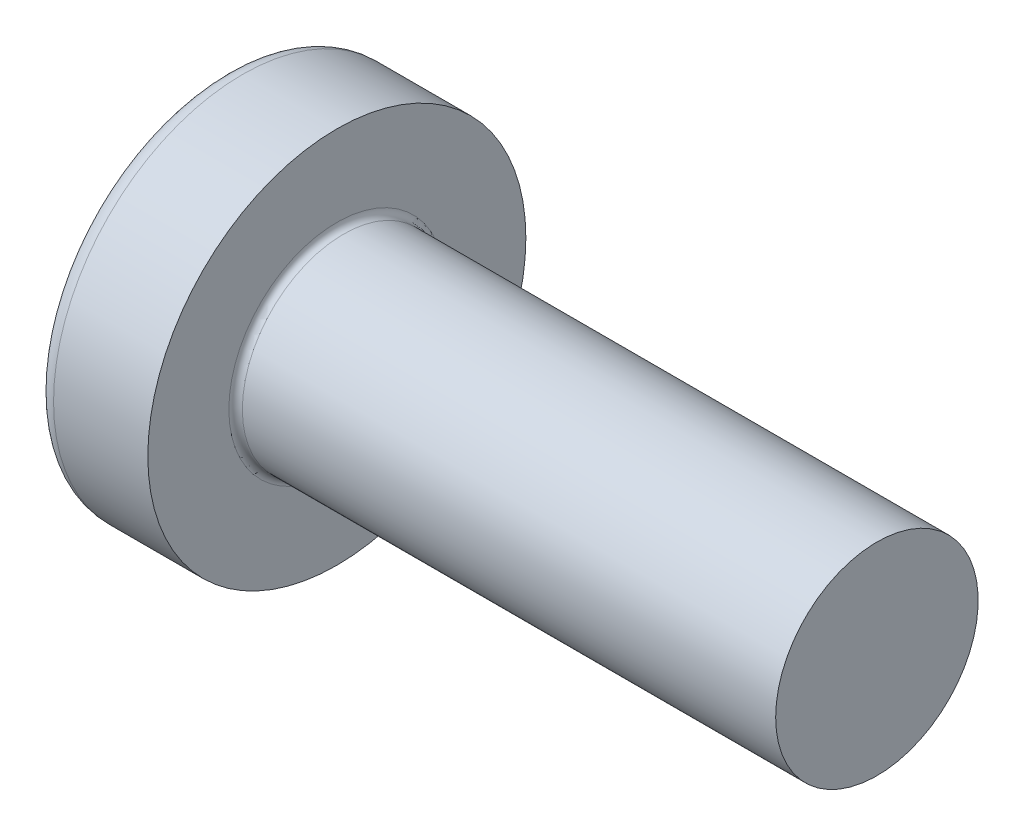
ISO-10303-21;
HEADER;
FILE_DESCRIPTION(('STEP AP214'),'2;1');
FILE_NAME('part.step','',(''),(''),'','','');
FILE_SCHEMA(('AUTOMOTIVE_DESIGN { 1 0 10303 214 1 1 1 1 }'));
ENDSEC;
DATA;
#1=APPLICATION_CONTEXT('core data for automotive mechanical design processes');
#2=APPLICATION_PROTOCOL_DEFINITION('international standard','automotive_design',2000,#1);
#3=PRODUCT_CONTEXT('',#1,'mechanical');
#4=PRODUCT('Part','Part','',(#3));
#5=PRODUCT_RELATED_PRODUCT_CATEGORY('part','',(#4));
#6=PRODUCT_DEFINITION_FORMATION('','',#4);
#7=PRODUCT_DEFINITION_CONTEXT('part definition',#1,'design');
#8=PRODUCT_DEFINITION('design','',#6,#7);
#9=PRODUCT_DEFINITION_SHAPE('','',#8);
#10=(LENGTH_UNIT() NAMED_UNIT(*) SI_UNIT(.MILLI.,.METRE.));
#11=(NAMED_UNIT(*) PLANE_ANGLE_UNIT() SI_UNIT($,.RADIAN.));
#12=(NAMED_UNIT(*) SI_UNIT($,.STERADIAN.) SOLID_ANGLE_UNIT());
#13=UNCERTAINTY_MEASURE_WITH_UNIT(LENGTH_MEASURE(1.E-05),#10,'distance_accuracy_value','');
#14=(GEOMETRIC_REPRESENTATION_CONTEXT(3) GLOBAL_UNCERTAINTY_ASSIGNED_CONTEXT((#13)) GLOBAL_UNIT_ASSIGNED_CONTEXT((#10,
#11,#12)) REPRESENTATION_CONTEXT('',''));
#15=CARTESIAN_POINT('',(0.,0.,0.));
#16=DIRECTION('',(0.,0.,1.));
#17=DIRECTION('',(1.,0.,0.));
#18=AXIS2_PLACEMENT_3D('',#15,#16,#17);
#19=CARTESIAN_POINT('',(5.,0.,0.));
#20=DIRECTION('',(-1.,0.,0.));
#21=DIRECTION('',(0.,1.,0.));
#22=AXIS2_PLACEMENT_3D('',#19,#20,#21);
#23=SPHERICAL_SURFACE('',#22,5.);
#24=CARTESIAN_POINT('',(0.775371598933733,0.,0.));
#25=DIRECTION('',(-1.,0.,0.));
#26=DIRECTION('',(0.,0.,1.));
#27=AXIS2_PLACEMENT_3D('',#24,#25,#26);
#28=CIRCLE('',#27,2.67441860465116);
#29=CARTESIAN_POINT('',(0.775371598933733,0.,2.67441860465116));
#30=VERTEX_POINT('',#29);
#31=EDGE_CURVE('E239',#30,#30,#28,.T.);
#32=ORIENTED_EDGE('',*,*,#31,.T.);
#33=EDGE_LOOP('',(#32));
#34=FACE_BOUND('',#33,.T.);
#35=CARTESIAN_POINT('',(0.0457951200896417,0.,0.));
#36=DIRECTION('',(1.,0.,0.));
#37=DIRECTION('',(0.,0.,-1.));
#38=AXIS2_PLACEMENT_3D('',#35,#36,#37);
#39=CIRCLE('',#38,0.675169614150692);
#40=CARTESIAN_POINT('',(0.0457951200896426,-0.369999999999998,-0.564760133040918));
#41=VERTEX_POINT('',#40);
#42=CARTESIAN_POINT('',(0.0457951200896417,-0.564760133040916,-0.37));
#43=VERTEX_POINT('',#42);
#44=EDGE_CURVE('E377',#41,#43,#39,.F.);
#45=ORIENTED_EDGE('',*,*,#44,.F.);
#46=CARTESIAN_POINT('',(5.,-0.37,0.));
#47=DIRECTION('',(0.,1.,0.));
#48=DIRECTION('',(0.,0.,1.));
#49=AXIS2_PLACEMENT_3D('',#46,#47,#48);
#50=CIRCLE('',#49,4.98629120689917);
#51=CARTESIAN_POINT('',(0.187869731256034,-0.369999999999995,-1.30633161051784));
#52=VERTEX_POINT('',#51);
#53=EDGE_CURVE('E303',#52,#41,#50,.T.);
#54=ORIENTED_EDGE('',*,*,#53,.F.);
#55=CARTESIAN_POINT('',(4.56358245832426,0.,0.875318202045668));
#56=DIRECTION('',(0.446197800778958,0.,-0.89493436774996));
#57=DIRECTION('',(-0.89493436774996,0.,-0.446197800778958));
#58=AXIS2_PLACEMENT_3D('',#55,#56,#57);
#59=CIRCLE('',#58,4.90340267309195);
#60=CARTESIAN_POINT('',(0.187869731256035,0.370000000000005,-1.30633161051784));
#61=VERTEX_POINT('',#60);
#62=EDGE_CURVE('E275',#52,#61,#59,.T.);
#63=ORIENTED_EDGE('',*,*,#62,.T.);
#64=CARTESIAN_POINT('',(5.,0.37,0.));
#65=DIRECTION('',(0.,-1.,0.));
#66=DIRECTION('',(0.,0.,-1.));
#67=AXIS2_PLACEMENT_3D('',#64,#65,#66);
#68=CIRCLE('',#67,4.98629120689917);
#69=CARTESIAN_POINT('',(0.0457951200896421,0.370000000000002,-0.564760133040916));
#70=VERTEX_POINT('',#69);
#71=EDGE_CURVE('E330',#70,#61,#68,.T.);
#72=ORIENTED_EDGE('',*,*,#71,.F.);
#73=CARTESIAN_POINT('',(0.0457951200896417,0.564760133040915,-0.37));
#74=VERTEX_POINT('',#73);
#75=EDGE_CURVE('E396',#74,#70,#39,.F.);
#76=ORIENTED_EDGE('',*,*,#75,.F.);
#77=CARTESIAN_POINT('',(5.,0.,-0.37));
#78=DIRECTION('',(0.,0.,1.));
#79=DIRECTION('',(1.,0.,0.));
#80=AXIS2_PLACEMENT_3D('',#77,#78,#79);
#81=CIRCLE('',#80,4.98629120689917);
#82=CARTESIAN_POINT('',(0.187869731256034,1.30633161051784,-0.37));
#83=VERTEX_POINT('',#82);
#84=EDGE_CURVE('E269',#83,#74,#81,.T.);
#85=ORIENTED_EDGE('',*,*,#84,.F.);
#86=CARTESIAN_POINT('',(4.56358245832426,-0.875318202045668,0.));
#87=DIRECTION('',(0.446197800778958,0.894934367749961,0.));
#88=DIRECTION('',(-0.89493436774996,0.446197800778958,0.));
#89=AXIS2_PLACEMENT_3D('',#86,#87,#88);
#90=CIRCLE('',#89,4.90340267309195);
#91=CARTESIAN_POINT('',(0.187869731256034,1.30633161051784,0.37));
#92=VERTEX_POINT('',#91);
#93=EDGE_CURVE('E272',#83,#92,#90,.T.);
#94=ORIENTED_EDGE('',*,*,#93,.T.);
#95=CARTESIAN_POINT('',(5.,0.,0.37));
#96=DIRECTION('',(0.,0.,-1.));
#97=DIRECTION('',(0.,1.,0.));
#98=AXIS2_PLACEMENT_3D('',#95,#96,#97);
#99=CIRCLE('',#98,4.98629120689917);
#100=CARTESIAN_POINT('',(0.0457951200896417,0.564760133040915,0.37));
#101=VERTEX_POINT('',#100);
#102=EDGE_CURVE('E265',#101,#92,#99,.T.);
#103=ORIENTED_EDGE('',*,*,#102,.F.);
#104=CARTESIAN_POINT('',(0.0457951200896426,0.369999999999998,0.564760133040918));
#105=VERTEX_POINT('',#104);
#106=EDGE_CURVE('E395',#105,#101,#39,.F.);
#107=ORIENTED_EDGE('',*,*,#106,.F.);
#108=CARTESIAN_POINT('',(0.187869731256033,0.369999999999995,1.30633161051784));
#109=VERTEX_POINT('',#108);
#110=EDGE_CURVE('E285',#109,#105,#68,.T.);
#111=ORIENTED_EDGE('',*,*,#110,.F.);
#112=CARTESIAN_POINT('',(4.56358245832426,0.,-0.875318202045669));
#113=DIRECTION('',(0.446197800778958,0.,0.894934367749961));
#114=DIRECTION('',(0.89493436774996,0.,-0.446197800778958));
#115=AXIS2_PLACEMENT_3D('',#112,#113,#114);
#116=CIRCLE('',#115,4.90340267309195);
#117=CARTESIAN_POINT('',(0.187869731256034,-0.370000000000005,1.30633161051784));
#118=VERTEX_POINT('',#117);
#119=EDGE_CURVE('E50',#109,#118,#116,.T.);
#120=ORIENTED_EDGE('',*,*,#119,.T.);
#121=CARTESIAN_POINT('',(0.0457951200896421,-0.370000000000002,0.564760133040916));
#122=VERTEX_POINT('',#121);
#123=EDGE_CURVE('E282',#122,#118,#50,.T.);
#124=ORIENTED_EDGE('',*,*,#123,.F.);
#125=CARTESIAN_POINT('',(0.0457951200896417,-0.564760133040916,0.37));
#126=VERTEX_POINT('',#125);
#127=EDGE_CURVE('E431',#126,#122,#39,.F.);
#128=ORIENTED_EDGE('',*,*,#127,.F.);
#129=CARTESIAN_POINT('',(0.187869731256033,-1.30633161051784,0.37));
#130=VERTEX_POINT('',#129);
#131=EDGE_CURVE('E266',#130,#126,#99,.T.);
#132=ORIENTED_EDGE('',*,*,#131,.F.);
#133=CARTESIAN_POINT('',(4.56358245832426,0.875318202045668,0.));
#134=DIRECTION('',(0.446197800778958,-0.89493436774996,0.));
#135=DIRECTION('',(0.89493436774996,0.446197800778958,0.));
#136=AXIS2_PLACEMENT_3D('',#133,#134,#135);
#137=CIRCLE('',#136,4.90340267309195);
#138=CARTESIAN_POINT('',(0.187869731256033,-1.30633161051784,-0.37));
#139=VERTEX_POINT('',#138);
#140=EDGE_CURVE('E262',#130,#139,#137,.T.);
#141=ORIENTED_EDGE('',*,*,#140,.T.);
#142=EDGE_CURVE('E65',#43,#139,#81,.T.);
#143=ORIENTED_EDGE('',*,*,#142,.F.);
#144=EDGE_LOOP('',(#45,#54,#63,#72,#76,#85,#94,#103,#107,#111,#120,#124,#128,#132,#141,#143));
#145=FACE_BOUND('',#144,.T.);
#146=ADVANCED_FACE('F37',(#34,#145),#23,.T.);
#147=CARTESIAN_POINT('',(1.75,0.527482216012805,-0.37));
#148=DIRECTION('',(0.,0.,1.));
#149=DIRECTION('',(1.,0.,0.));
#150=AXIS2_PLACEMENT_3D('',#147,#148,#149);
#151=PLANE('',#150);
#152=ORIENTED_EDGE('',*,*,#84,.T.);
#153=CARTESIAN_POINT('',(-0.987293237053716,0.649401255967161,-0.37));
#154=CARTESIAN_POINT('',(-0.781914975317084,0.632865887002871,-0.37));
#155=CARTESIAN_POINT('',(-0.576547882393372,0.616188977635081,-0.37));
#156=CARTESIAN_POINT('',(-0.165841599226327,0.582441031964227,-0.37));
#157=CARTESIAN_POINT('',(0.0394975903090452,0.56536998705488,-0.37));
#158=CARTESIAN_POINT('',(0.450133475422572,0.530723441326535,-0.37));
#159=CARTESIAN_POINT('',(0.655430171010573,0.513147940624557,-0.37));
#160=CARTESIAN_POINT('',(1.06596140177934,0.477314957985794,-0.37));
#161=CARTESIAN_POINT('',(1.2711959378071,0.459057485806066,-0.37));
#162=CARTESIAN_POINT('',(1.61065292365626,0.428051938688768,-0.37));
#163=CARTESIAN_POINT('',(1.74490059995643,0.415580824990931,-0.37));
#164=CARTESIAN_POINT('',(2.01334321762763,0.390092023404979,-0.37));
#165=CARTESIAN_POINT('',(2.14753815934577,0.377074339177353,-0.37));
#166=CARTESIAN_POINT('',(2.41586354151957,0.350315629452843,-0.37));
#167=CARTESIAN_POINT('',(2.5499939784531,0.33657456817765,-0.37));
#168=CARTESIAN_POINT('',(2.81814173295471,0.308004077741875,-0.37));
#169=CARTESIAN_POINT('',(2.95215904765134,0.293174621747065,-0.37));
#170=CARTESIAN_POINT('',(3.0860955068368,0.277618485071816,-0.37));
#171=B_SPLINE_CURVE_WITH_KNOTS('',3,(#153,#154,#155,#156,#157,#158,#159,#160,#161,#162,#163,
#164,#165,#166,#167,#168,#169,#170),.UNSPECIFIED.,.F.,.F.,(4,2,2,2,2,2,2,2,4),(0.,
0.618128793984691,1.23627109812525,1.85441325887562,2.4725465791681,2.87702276218609,
3.28149623678161,3.68598973550942,4.09049321032311),.UNSPECIFIED.);
#172=CARTESIAN_POINT('',(1.75,0.415013252800437,-0.370000000000001));
#173=VERTEX_POINT('',#172);
#174=EDGE_CURVE('E417',#74,#173,#171,.T.);
#175=ORIENTED_EDGE('',*,*,#174,.T.);
#176=DIRECTION('',(0.,1.,0.));
#177=VECTOR('',#176,1.);
#178=CARTESIAN_POINT('',(1.75,-0.527482216012805,-0.37));
#179=LINE('',#178,#177);
#180=CARTESIAN_POINT('',(1.75,0.527482216012805,-0.37));
#181=VERTEX_POINT('',#180);
#182=EDGE_CURVE('E359',#173,#181,#179,.T.);
#183=ORIENTED_EDGE('',*,*,#182,.T.);
#184=DIRECTION('',(0.89493436774996,-0.446197800778958,0.));
#185=VECTOR('',#184,1.);
#186=CARTESIAN_POINT('',(0.,1.4,-0.37));
#187=LINE('',#186,#185);
#188=EDGE_CURVE('E240',#83,#181,#187,.T.);
#189=ORIENTED_EDGE('',*,*,#188,.F.);
#190=EDGE_LOOP('',(#152,#175,#183,#189));
#191=FACE_BOUND('',#190,.T.);
#192=ADVANCED_FACE('F195',(#191),#151,.T.);
#193=CARTESIAN_POINT('',(1.75,-0.527482216012805,-0.37));
#194=VERTEX_POINT('',#193);
#195=CARTESIAN_POINT('',(1.75,-0.415013252800437,-0.370000000000001));
#196=VERTEX_POINT('',#195);
#197=EDGE_CURVE('E248',#194,#196,#179,.T.);
#198=ORIENTED_EDGE('',*,*,#197,.T.);
#199=CARTESIAN_POINT('',(-0.987293237053716,-0.649401255967161,-0.37));
#200=CARTESIAN_POINT('',(-0.781914975317084,-0.632865887002871,-0.37));
#201=CARTESIAN_POINT('',(-0.576547882393372,-0.616188977635081,-0.37));
#202=CARTESIAN_POINT('',(-0.165841599226327,-0.582441031964227,-0.37));
#203=CARTESIAN_POINT('',(0.0394975903090452,-0.56536998705488,-0.37));
#204=CARTESIAN_POINT('',(0.450133475422572,-0.530723441326535,-0.37));
#205=CARTESIAN_POINT('',(0.655430171010573,-0.513147940624557,-0.37));
#206=CARTESIAN_POINT('',(1.06596140177934,-0.477314957985794,-0.37));
#207=CARTESIAN_POINT('',(1.2711959378071,-0.459057485806066,-0.37));
#208=CARTESIAN_POINT('',(1.61065292365626,-0.428051938688768,-0.37));
#209=CARTESIAN_POINT('',(1.74490059995643,-0.415580824990931,-0.37));
#210=CARTESIAN_POINT('',(2.01334321762763,-0.390092023404979,-0.37));
#211=CARTESIAN_POINT('',(2.14753815934577,-0.377074339177353,-0.37));
#212=CARTESIAN_POINT('',(2.41586354151957,-0.350315629452843,-0.37));
#213=CARTESIAN_POINT('',(2.5499939784531,-0.33657456817765,-0.37));
#214=CARTESIAN_POINT('',(2.81814173295471,-0.308004077741875,-0.37));
#215=CARTESIAN_POINT('',(2.95215904765134,-0.293174621747065,-0.37));
#216=CARTESIAN_POINT('',(3.0860955068368,-0.277618485071816,-0.37));
#217=B_SPLINE_CURVE_WITH_KNOTS('',3,(#199,#200,#201,#202,#203,#204,#205,#206,#207,#208,#209,
#210,#211,#212,#213,#214,#215,#216),.UNSPECIFIED.,.F.,.F.,(4,2,2,2,2,2,2,2,4),(0.,
0.618128793984691,1.23627109812525,1.85441325887562,2.4725465791681,2.87702276218609,
3.28149623678161,3.68598973550942,4.09049321032311),.UNSPECIFIED.);
#218=EDGE_CURVE('E394',#196,#43,#217,.F.);
#219=ORIENTED_EDGE('',*,*,#218,.T.);
#220=ORIENTED_EDGE('',*,*,#142,.T.);
#221=DIRECTION('',(0.89493436774996,0.446197800778958,0.));
#222=VECTOR('',#221,1.);
#223=CARTESIAN_POINT('',(0.,-1.4,-0.37));
#224=LINE('',#223,#222);
#225=EDGE_CURVE('E333',#139,#194,#224,.T.);
#226=ORIENTED_EDGE('',*,*,#225,.T.);
#227=EDGE_LOOP('',(#198,#219,#220,#226));
#228=FACE_BOUND('',#227,.T.);
#229=ADVANCED_FACE('F201',(#228),#151,.T.);
#230=CARTESIAN_POINT('',(1.75,-0.527482216012805,0.37));
#231=DIRECTION('',(0.,0.,-1.));
#232=DIRECTION('',(0.,1.,0.));
#233=AXIS2_PLACEMENT_3D('',#230,#231,#232);
#234=PLANE('',#233);
#235=DIRECTION('',(0.,-1.,0.));
#236=VECTOR('',#235,1.);
#237=CARTESIAN_POINT('',(1.75,0.527482216012805,0.37));
#238=LINE('',#237,#236);
#239=CARTESIAN_POINT('',(1.75,0.527482216012805,0.37));
#240=VERTEX_POINT('',#239);
#241=CARTESIAN_POINT('',(1.75,0.415013252800437,0.370000000000001));
#242=VERTEX_POINT('',#241);
#243=EDGE_CURVE('E342',#240,#242,#238,.T.);
#244=ORIENTED_EDGE('',*,*,#243,.T.);
#245=CARTESIAN_POINT('',(-0.987293237053716,0.649401255967161,0.37));
#246=CARTESIAN_POINT('',(-0.781914975317084,0.632865887002871,0.37));
#247=CARTESIAN_POINT('',(-0.576547882393372,0.616188977635081,0.37));
#248=CARTESIAN_POINT('',(-0.165841599226327,0.582441031964227,0.37));
#249=CARTESIAN_POINT('',(0.0394975903090453,0.56536998705488,0.37));
#250=CARTESIAN_POINT('',(0.450133475422572,0.530723441326535,0.37));
#251=CARTESIAN_POINT('',(0.655430171010574,0.513147940624557,0.37));
#252=CARTESIAN_POINT('',(1.06596140177934,0.477314957985794,0.37));
#253=CARTESIAN_POINT('',(1.2711959378071,0.459057485806066,0.37));
#254=CARTESIAN_POINT('',(1.61065292365626,0.428051938688768,0.37));
#255=CARTESIAN_POINT('',(1.74490059995643,0.415580824990931,0.37));
#256=CARTESIAN_POINT('',(2.01334321762763,0.39009202340498,0.37));
#257=CARTESIAN_POINT('',(2.14753815934577,0.377074339177353,0.37));
#258=CARTESIAN_POINT('',(2.41586354151957,0.350315629452843,0.37));
#259=CARTESIAN_POINT('',(2.5499939784531,0.33657456817765,0.37));
#260=CARTESIAN_POINT('',(2.81814173295471,0.308004077741875,0.37));
#261=CARTESIAN_POINT('',(2.95215904765134,0.293174621747065,0.37));
#262=CARTESIAN_POINT('',(3.0860955068368,0.277618485071816,0.37));
#263=B_SPLINE_CURVE_WITH_KNOTS('',3,(#245,#246,#247,#248,#249,#250,#251,#252,#253,#254,#255,
#256,#257,#258,#259,#260,#261,#262),.UNSPECIFIED.,.F.,.F.,(4,2,2,2,2,2,2,2,4),(0.,
0.618128793984691,1.23627109812525,1.85441325887562,2.4725465791681,2.87702276218609,
3.28149623678161,3.68598973550942,4.09049321032311),.UNSPECIFIED.);
#264=EDGE_CURVE('E677',#242,#101,#263,.F.);
#265=ORIENTED_EDGE('',*,*,#264,.T.);
#266=ORIENTED_EDGE('',*,*,#102,.T.);
#267=DIRECTION('',(0.89493436774996,-0.446197800778958,0.));
#268=VECTOR('',#267,1.);
#269=CARTESIAN_POINT('',(0.,1.4,0.37));
#270=LINE('',#269,#268);
#271=EDGE_CURVE('E245',#92,#240,#270,.T.);
#272=ORIENTED_EDGE('',*,*,#271,.T.);
#273=EDGE_LOOP('',(#244,#265,#266,#272));
#274=FACE_BOUND('',#273,.T.);
#275=ADVANCED_FACE('F413',(#274),#234,.T.);
#276=ORIENTED_EDGE('',*,*,#131,.T.);
#277=CARTESIAN_POINT('',(-0.987293237069635,-0.649401255968442,0.37));
#278=CARTESIAN_POINT('',(-0.781914975331301,-0.632865887004023,0.37));
#279=CARTESIAN_POINT('',(-0.576547882405888,-0.616188977636102,0.37));
#280=CARTESIAN_POINT('',(-0.16584159923544,-0.582441031964983,0.37));
#281=CARTESIAN_POINT('',(0.0394975903016338,-0.5653699870555,0.37));
#282=CARTESIAN_POINT('',(0.450133475420601,-0.530723441326706,0.37));
#283=CARTESIAN_POINT('',(0.655430171012341,-0.513147940624409,0.37));
#284=CARTESIAN_POINT('',(1.06596140178858,-0.477314957984981,0.37));
#285=CARTESIAN_POINT('',(1.27119593782008,-0.459057485804908,0.37));
#286=CARTESIAN_POINT('',(1.61065292367297,-0.428051938687225,0.37));
#287=CARTESIAN_POINT('',(1.74490059997313,-0.415580824989368,0.37));
#288=CARTESIAN_POINT('',(2.01334321764434,-0.390092023403371,0.37));
#289=CARTESIAN_POINT('',(2.14753815936247,-0.377074339175718,0.37));
#290=CARTESIAN_POINT('',(2.41586354153627,-0.350315629451146,0.37));
#291=CARTESIAN_POINT('',(2.54999397846979,-0.336574568175918,0.37));
#292=CARTESIAN_POINT('',(2.8181417329714,-0.308004077740054,0.37));
#293=CARTESIAN_POINT('',(2.95215904766802,-0.29317462174519,0.37));
#294=CARTESIAN_POINT('',(3.08609550685347,-0.277618485069873,0.37));
#295=B_SPLINE_CURVE_WITH_KNOTS('',3,(#277,#278,#279,#280,#281,#282,#283,#284,#285,#286,#287,
#288,#289,#290,#291,#292,#293,#294),.UNSPECIFIED.,.F.,.F.,(4,2,2,2,2,2,2,2,4),(0.,
0.61812879398981,1.23627109813549,1.85441325889711,2.47254657920086,2.87702276221884,
3.28149623681437,3.68598973554218,4.09049321035586),.UNSPECIFIED.);
#296=CARTESIAN_POINT('',(1.75,-0.415013252800437,0.37));
#297=VERTEX_POINT('',#296);
#298=EDGE_CURVE('E432',#126,#297,#295,.T.);
#299=ORIENTED_EDGE('',*,*,#298,.T.);
#300=CARTESIAN_POINT('',(1.75,-0.527482216012805,0.37));
#301=VERTEX_POINT('',#300);
#302=EDGE_CURVE('E344',#297,#301,#238,.T.);
#303=ORIENTED_EDGE('',*,*,#302,.T.);
#304=DIRECTION('',(0.89493436774996,0.446197800778958,0.));
#305=VECTOR('',#304,1.);
#306=CARTESIAN_POINT('',(0.,-1.4,0.37));
#307=LINE('',#306,#305);
#308=EDGE_CURVE('E335',#130,#301,#307,.T.);
#309=ORIENTED_EDGE('',*,*,#308,.F.);
#310=EDGE_LOOP('',(#276,#299,#303,#309));
#311=FACE_BOUND('',#310,.T.);
#312=ADVANCED_FACE('F523',(#311),#234,.T.);
#313=CARTESIAN_POINT('',(1.75,0.527482216012805,0.37));
#314=DIRECTION('',(0.446197800778958,0.894934367749961,0.));
#315=DIRECTION('',(-0.89493436774996,0.446197800778958,0.));
#316=AXIS2_PLACEMENT_3D('',#313,#314,#315);
#317=PLANE('',#316);
#318=CARTESIAN_POINT('',(2.66965234556629,0.0689604865315897,0.));
#319=DIRECTION('',(0.446197800778958,0.894934367749961,0.));
#320=DIRECTION('',(-0.89493436774996,0.446197800778958,0.));
#321=AXIS2_PLACEMENT_3D('',#318,#319,#320);
#322=ELLIPSE('',#321,1.10195891266117,0.486831719863514);
#323=CARTESIAN_POINT('',(1.75,0.527482216012806,0.175779725196677));
#324=VERTEX_POINT('',#323);
#325=CARTESIAN_POINT('',(1.75,0.527482216012806,-0.175779725196677));
#326=VERTEX_POINT('',#325);
#327=EDGE_CURVE('E308',#324,#326,#322,.F.);
#328=ORIENTED_EDGE('',*,*,#327,.F.);
#329=DIRECTION('',(0.,0.,-1.));
#330=VECTOR('',#329,1.);
#331=CARTESIAN_POINT('',(1.75,0.527482216012805,0.37));
#332=LINE('',#331,#330);
#333=EDGE_CURVE('E345',#240,#324,#332,.T.);
#334=ORIENTED_EDGE('',*,*,#333,.F.);
#335=ORIENTED_EDGE('',*,*,#271,.F.);
#336=ORIENTED_EDGE('',*,*,#93,.F.);
#337=ORIENTED_EDGE('',*,*,#188,.T.);
#338=EDGE_CURVE('E347',#326,#181,#332,.T.);
#339=ORIENTED_EDGE('',*,*,#338,.F.);
#340=EDGE_LOOP('',(#328,#334,#335,#336,#337,#339));
#341=FACE_BOUND('',#340,.T.);
#342=ADVANCED_FACE('F411',(#341),#317,.F.);
#343=CARTESIAN_POINT('',(1.75,-0.527482216012805,-0.37));
#344=DIRECTION('',(0.446197800778958,-0.89493436774996,0.));
#345=DIRECTION('',(0.89493436774996,0.446197800778958,0.));
#346=AXIS2_PLACEMENT_3D('',#343,#344,#345);
#347=PLANE('',#346);
#348=CARTESIAN_POINT('',(2.66965234556629,-0.06896048653159,0.));
#349=DIRECTION('',(0.446197800778958,-0.89493436774996,0.));
#350=DIRECTION('',(-0.89493436774996,-0.446197800778958,0.));
#351=AXIS2_PLACEMENT_3D('',#348,#349,#350);
#352=ELLIPSE('',#351,1.10195891266117,0.486831719863513);
#353=CARTESIAN_POINT('',(1.75,-0.527482216012806,-0.175779725196678));
#354=VERTEX_POINT('',#353);
#355=CARTESIAN_POINT('',(1.75,-0.527482216012806,0.175779725196678));
#356=VERTEX_POINT('',#355);
#357=EDGE_CURVE('E679',#354,#356,#352,.F.);
#358=ORIENTED_EDGE('',*,*,#357,.F.);
#359=DIRECTION('',(0.,0.,1.));
#360=VECTOR('',#359,1.);
#361=CARTESIAN_POINT('',(1.75,-0.527482216012805,-0.37));
#362=LINE('',#361,#360);
#363=EDGE_CURVE('E338',#194,#354,#362,.T.);
#364=ORIENTED_EDGE('',*,*,#363,.F.);
#365=ORIENTED_EDGE('',*,*,#225,.F.);
#366=ORIENTED_EDGE('',*,*,#140,.F.);
#367=ORIENTED_EDGE('',*,*,#308,.T.);
#368=EDGE_CURVE('E341',#356,#301,#362,.T.);
#369=ORIENTED_EDGE('',*,*,#368,.F.);
#370=EDGE_LOOP('',(#358,#364,#365,#366,#367,#369));
#371=FACE_BOUND('',#370,.T.);
#372=ADVANCED_FACE('F510',(#371),#347,.F.);
#373=CARTESIAN_POINT('',(1.75,0.527482216012805,-0.37));
#374=DIRECTION('',(-1.,0.,0.));
#375=DIRECTION('',(0.,0.,1.));
#376=AXIS2_PLACEMENT_3D('',#373,#374,#375);
#377=PLANE('',#376);
#378=DIRECTION('',(0.,1.,0.));
#379=VECTOR('',#378,1.);
#380=CARTESIAN_POINT('',(1.75,-0.370000000000002,0.527482216012804));
#381=LINE('',#380,#379);
#382=CARTESIAN_POINT('',(1.75,-0.370000000000002,0.527482216012804));
#383=VERTEX_POINT('',#382);
#384=CARTESIAN_POINT('',(1.75,-0.175779725196681,0.527482216012805));
#385=VERTEX_POINT('',#384);
#386=EDGE_CURVE('E323',#383,#385,#381,.T.);
#387=ORIENTED_EDGE('',*,*,#386,.T.);
#388=CARTESIAN_POINT('',(1.75,0.,0.));
#389=DIRECTION('',(-1.,0.,0.));
#390=DIRECTION('',(0.,0.,1.));
#391=AXIS2_PLACEMENT_3D('',#388,#389,#390);
#392=CIRCLE('',#391,0.556);
#393=CARTESIAN_POINT('',(1.75,-0.370000000000001,0.415013252800436));
#394=VERTEX_POINT('',#393);
#395=EDGE_CURVE('E705',#394,#385,#392,.T.);
#396=ORIENTED_EDGE('',*,*,#395,.F.);
#397=DIRECTION('',(0.,0.,-1.));
#398=VECTOR('',#397,1.);
#399=CARTESIAN_POINT('',(1.75,-0.370000000000002,0.527482216012804));
#400=LINE('',#399,#398);
#401=EDGE_CURVE('E319',#383,#394,#400,.T.);
#402=ORIENTED_EDGE('',*,*,#401,.F.);
#403=EDGE_LOOP('',(#387,#396,#402));
#404=FACE_BOUND('',#403,.T.);
#405=ADVANCED_FACE('F467',(#404),#377,.T.);
#406=ORIENTED_EDGE('',*,*,#302,.F.);
#407=EDGE_CURVE('E710',#356,#297,#392,.T.);
#408=ORIENTED_EDGE('',*,*,#407,.F.);
#409=ORIENTED_EDGE('',*,*,#368,.T.);
#410=EDGE_LOOP('',(#406,#408,#409));
#411=FACE_BOUND('',#410,.T.);
#412=ADVANCED_FACE('F497',(#411),#377,.T.);
#413=ORIENTED_EDGE('',*,*,#363,.T.);
#414=EDGE_CURVE('E388',#196,#354,#392,.T.);
#415=ORIENTED_EDGE('',*,*,#414,.F.);
#416=ORIENTED_EDGE('',*,*,#197,.F.);
#417=EDGE_LOOP('',(#413,#415,#416));
#418=FACE_BOUND('',#417,.T.);
#419=ADVANCED_FACE('F491',(#418),#377,.T.);
#420=CARTESIAN_POINT('',(1.75,-0.369999999999998,-0.415013252800438));
#421=VERTEX_POINT('',#420);
#422=CARTESIAN_POINT('',(1.75,-0.369999999999998,-0.527482216012807));
#423=VERTEX_POINT('',#422);
#424=EDGE_CURVE('E322',#421,#423,#400,.T.);
#425=ORIENTED_EDGE('',*,*,#424,.F.);
#426=CARTESIAN_POINT('',(1.75,-0.175779725196678,-0.527482216012806));
#427=VERTEX_POINT('',#426);
#428=EDGE_CURVE('E57',#427,#421,#392,.T.);
#429=ORIENTED_EDGE('',*,*,#428,.F.);
#430=DIRECTION('',(0.,-1.,0.));
#431=VECTOR('',#430,1.);
#432=CARTESIAN_POINT('',(1.75,0.370000000000002,-0.527482216012804));
#433=LINE('',#432,#431);
#434=EDGE_CURVE('E318',#427,#423,#433,.T.);
#435=ORIENTED_EDGE('',*,*,#434,.T.);
#436=EDGE_LOOP('',(#425,#429,#435));
#437=FACE_BOUND('',#436,.T.);
#438=ADVANCED_FACE('F383',(#437),#377,.T.);
#439=CARTESIAN_POINT('',(1.75,0.370000000000002,-0.527482216012804));
#440=VERTEX_POINT('',#439);
#441=CARTESIAN_POINT('',(1.75,0.175779725196681,-0.527482216012805));
#442=VERTEX_POINT('',#441);
#443=EDGE_CURVE('E315',#440,#442,#433,.T.);
#444=ORIENTED_EDGE('',*,*,#443,.T.);
#445=CARTESIAN_POINT('',(1.75,0.370000000000001,-0.415013252800436));
#446=VERTEX_POINT('',#445);
#447=EDGE_CURVE('E387',#446,#442,#392,.T.);
#448=ORIENTED_EDGE('',*,*,#447,.F.);
#449=DIRECTION('',(0.,0.,1.));
#450=VECTOR('',#449,1.);
#451=CARTESIAN_POINT('',(1.75,0.370000000000002,-0.527482216012804));
#452=LINE('',#451,#450);
#453=EDGE_CURVE('E327',#440,#446,#452,.T.);
#454=ORIENTED_EDGE('',*,*,#453,.F.);
#455=EDGE_LOOP('',(#444,#448,#454));
#456=FACE_BOUND('',#455,.T.);
#457=ADVANCED_FACE('F479',(#456),#377,.T.);
#458=ORIENTED_EDGE('',*,*,#182,.F.);
#459=EDGE_CURVE('E694',#326,#173,#392,.T.);
#460=ORIENTED_EDGE('',*,*,#459,.F.);
#461=ORIENTED_EDGE('',*,*,#338,.T.);
#462=EDGE_LOOP('',(#458,#460,#461));
#463=FACE_BOUND('',#462,.T.);
#464=ADVANCED_FACE('F473',(#463),#377,.T.);
#465=ORIENTED_EDGE('',*,*,#333,.T.);
#466=EDGE_CURVE('E696',#242,#324,#392,.T.);
#467=ORIENTED_EDGE('',*,*,#466,.F.);
#468=ORIENTED_EDGE('',*,*,#243,.F.);
#469=EDGE_LOOP('',(#465,#467,#468));
#470=FACE_BOUND('',#469,.T.);
#471=ADVANCED_FACE('F465',(#470),#377,.T.);
#472=CARTESIAN_POINT('',(1.75,0.369999999999999,0.415013252800439));
#473=VERTEX_POINT('',#472);
#474=CARTESIAN_POINT('',(1.75,0.369999999999998,0.527482216012807));
#475=VERTEX_POINT('',#474);
#476=EDGE_CURVE('E300',#473,#475,#452,.T.);
#477=ORIENTED_EDGE('',*,*,#476,.F.);
#478=CARTESIAN_POINT('',(1.75,0.175779725196678,0.527482216012806));
#479=VERTEX_POINT('',#478);
#480=EDGE_CURVE('E389',#479,#473,#392,.T.);
#481=ORIENTED_EDGE('',*,*,#480,.F.);
#482=EDGE_CURVE('E326',#479,#475,#381,.T.);
#483=ORIENTED_EDGE('',*,*,#482,.T.);
#484=EDGE_LOOP('',(#477,#481,#483));
#485=FACE_BOUND('',#484,.T.);
#486=ADVANCED_FACE('F459',(#485),#377,.T.);
#487=CARTESIAN_POINT('',(1.75,0.369999999999998,0.527482216012806));
#488=DIRECTION('',(0.,-1.,0.));
#489=DIRECTION('',(1.,0.,0.));
#490=AXIS2_PLACEMENT_3D('',#487,#488,#489);
#491=PLANE('',#490);
#492=ORIENTED_EDGE('',*,*,#110,.T.);
#493=CARTESIAN_POINT('',(-0.987293237069635,0.369999999999998,0.649401255968443));
#494=CARTESIAN_POINT('',(-0.781914975331301,0.369999999999998,0.632865887004024));
#495=CARTESIAN_POINT('',(-0.576547882405888,0.369999999999998,0.616188977636103));
#496=CARTESIAN_POINT('',(-0.16584159923544,0.369999999999998,0.582441031964984));
#497=CARTESIAN_POINT('',(0.0394975903016338,0.369999999999998,0.565369987055501));
#498=CARTESIAN_POINT('',(0.450133475420601,0.369999999999998,0.530723441326707));
#499=CARTESIAN_POINT('',(0.655430171012341,0.369999999999998,0.51314794062441));
#500=CARTESIAN_POINT('',(1.06596140178858,0.369999999999998,0.477314957984982));
#501=CARTESIAN_POINT('',(1.27119593782008,0.369999999999998,0.459057485804909));
#502=CARTESIAN_POINT('',(1.61065292367297,0.369999999999999,0.428051938687226));
#503=CARTESIAN_POINT('',(1.74490059997313,0.369999999999999,0.415580824989369));
#504=CARTESIAN_POINT('',(2.01334321764434,0.369999999999999,0.390092023403372));
#505=CARTESIAN_POINT('',(2.14753815936247,0.369999999999999,0.37707433917572));
#506=CARTESIAN_POINT('',(2.41586354153627,0.369999999999999,0.350315629451147));
#507=CARTESIAN_POINT('',(2.54999397846979,0.369999999999999,0.336574568175919));
#508=CARTESIAN_POINT('',(2.8181417329714,0.369999999999999,0.308004077740055));
#509=CARTESIAN_POINT('',(2.95215904766802,0.369999999999999,0.293174621745191));
#510=CARTESIAN_POINT('',(3.08609550685347,0.369999999999999,0.277618485069875));
#511=B_SPLINE_CURVE_WITH_KNOTS('',3,(#493,#494,#495,#496,#497,#498,#499,#500,#501,#502,#503,
#504,#505,#506,#507,#508,#509,#510),.UNSPECIFIED.,.F.,.F.,(4,2,2,2,2,2,2,2,4),(0.,
0.61812879398981,1.23627109813549,1.85441325889711,2.47254657920086,2.87702276221884,
3.28149623681436,3.68598973554218,4.09049321035586),.UNSPECIFIED.);
#512=EDGE_CURVE('E676',#105,#473,#511,.T.);
#513=ORIENTED_EDGE('',*,*,#512,.T.);
#514=ORIENTED_EDGE('',*,*,#476,.T.);
#515=DIRECTION('',(0.89493436774996,0.,-0.446197800778958));
#516=VECTOR('',#515,1.);
#517=CARTESIAN_POINT('',(0.,0.369999999999995,1.4));
#518=LINE('',#517,#516);
#519=EDGE_CURVE('E293',#109,#475,#518,.T.);
#520=ORIENTED_EDGE('',*,*,#519,.F.);
#521=EDGE_LOOP('',(#492,#513,#514,#520));
#522=FACE_BOUND('',#521,.T.);
#523=ADVANCED_FACE('F297',(#522),#491,.T.);
#524=CARTESIAN_POINT('',(1.75,-0.369999999999998,-0.527482216012807));
#525=DIRECTION('',(0.,1.,0.));
#526=DIRECTION('',(0.,0.,1.));
#527=AXIS2_PLACEMENT_3D('',#524,#525,#526);
#528=PLANE('',#527);
#529=ORIENTED_EDGE('',*,*,#401,.T.);
#530=CARTESIAN_POINT('',(-0.987293237053716,-0.370000000000002,0.64940125596716));
#531=CARTESIAN_POINT('',(-0.781914975317084,-0.370000000000002,0.63286588700287));
#532=CARTESIAN_POINT('',(-0.576547882393372,-0.370000000000002,0.61618897763508));
#533=CARTESIAN_POINT('',(-0.165841599226327,-0.370000000000002,0.582441031964225));
#534=CARTESIAN_POINT('',(0.0394975903090451,-0.370000000000002,0.565369987054878));
#535=CARTESIAN_POINT('',(0.450133475422572,-0.370000000000002,0.530723441326533));
#536=CARTESIAN_POINT('',(0.655430171010573,-0.370000000000002,0.513147940624555));
#537=CARTESIAN_POINT('',(1.06596140177934,-0.370000000000002,0.477314957985793));
#538=CARTESIAN_POINT('',(1.2711959378071,-0.370000000000002,0.459057485806065));
#539=CARTESIAN_POINT('',(1.61065292365626,-0.370000000000001,0.428051938688767));
#540=CARTESIAN_POINT('',(1.74490059995642,-0.370000000000001,0.41558082499093));
#541=CARTESIAN_POINT('',(2.01334321762763,-0.370000000000001,0.390092023404978));
#542=CARTESIAN_POINT('',(2.14753815934577,-0.370000000000001,0.377074339177352));
#543=CARTESIAN_POINT('',(2.41586354151957,-0.370000000000001,0.350315629452841));
#544=CARTESIAN_POINT('',(2.5499939784531,-0.370000000000001,0.336574568177649));
#545=CARTESIAN_POINT('',(2.81814173295471,-0.370000000000001,0.308004077741874));
#546=CARTESIAN_POINT('',(2.95215904765134,-0.370000000000001,0.293174621747063));
#547=CARTESIAN_POINT('',(3.0860955068368,-0.370000000000001,0.277618485071814));
#548=B_SPLINE_CURVE_WITH_KNOTS('',3,(#530,#531,#532,#533,#534,#535,#536,#537,#538,#539,#540,
#541,#542,#543,#544,#545,#546,#547),.UNSPECIFIED.,.F.,.F.,(4,2,2,2,2,2,2,2,4),(0.,
0.618128793984691,1.23627109812525,1.85441325887562,2.4725465791681,2.87702276218609,
3.28149623678161,3.68598973550942,4.09049321032311),.UNSPECIFIED.);
#549=EDGE_CURVE('E425',#394,#122,#548,.F.);
#550=ORIENTED_EDGE('',*,*,#549,.T.);
#551=ORIENTED_EDGE('',*,*,#123,.T.);
#552=DIRECTION('',(0.89493436774996,0.,-0.446197800778958));
#553=VECTOR('',#552,1.);
#554=CARTESIAN_POINT('',(0.,-0.370000000000005,1.4));
#555=LINE('',#554,#553);
#556=EDGE_CURVE('E295',#118,#383,#555,.T.);
#557=ORIENTED_EDGE('',*,*,#556,.T.);
#558=EDGE_LOOP('',(#529,#550,#551,#557));
#559=FACE_BOUND('',#558,.T.);
#560=ADVANCED_FACE('F230',(#559),#528,.T.);
#561=CARTESIAN_POINT('',(1.75,-0.370000000000002,0.527482216012804));
#562=DIRECTION('',(0.446197800778958,0.,0.894934367749961));
#563=DIRECTION('',(-0.89493436774996,0.,0.446197800778958));
#564=AXIS2_PLACEMENT_3D('',#561,#562,#563);
#565=PLANE('',#564);
#566=CARTESIAN_POINT('',(2.66965234556629,0.,0.0689604865315897));
#567=DIRECTION('',(0.446197800778958,0.,0.894934367749961));
#568=DIRECTION('',(-0.89493436774996,0.,0.446197800778958));
#569=AXIS2_PLACEMENT_3D('',#566,#567,#568);
#570=ELLIPSE('',#569,1.10195891266117,0.486831719863514);
#571=EDGE_CURVE('E423',#385,#479,#570,.F.);
#572=ORIENTED_EDGE('',*,*,#571,.F.);
#573=ORIENTED_EDGE('',*,*,#386,.F.);
#574=ORIENTED_EDGE('',*,*,#556,.F.);
#575=ORIENTED_EDGE('',*,*,#119,.F.);
#576=ORIENTED_EDGE('',*,*,#519,.T.);
#577=ORIENTED_EDGE('',*,*,#482,.F.);
#578=EDGE_LOOP('',(#572,#573,#574,#575,#576,#577));
#579=FACE_BOUND('',#578,.T.);
#580=ADVANCED_FACE('F291',(#579),#565,.F.);
#581=CARTESIAN_POINT('',(1.75,0.370000000000002,-0.527482216012804));
#582=DIRECTION('',(0.446197800778958,0.,-0.89493436774996));
#583=DIRECTION('',(0.89493436774996,0.,0.446197800778958));
#584=AXIS2_PLACEMENT_3D('',#581,#582,#583);
#585=PLANE('',#584);
#586=CARTESIAN_POINT('',(2.66965234556629,0.,-0.0689604865315901));
#587=DIRECTION('',(0.446197800778958,0.,-0.89493436774996));
#588=DIRECTION('',(-0.89493436774996,0.,-0.446197800778958));
#589=AXIS2_PLACEMENT_3D('',#586,#587,#588);
#590=ELLIPSE('',#589,1.10195891266117,0.486831719863513);
#591=EDGE_CURVE('E381',#442,#427,#590,.F.);
#592=ORIENTED_EDGE('',*,*,#591,.F.);
#593=ORIENTED_EDGE('',*,*,#443,.F.);
#594=DIRECTION('',(0.89493436774996,0.,0.446197800778958));
#595=VECTOR('',#594,1.);
#596=CARTESIAN_POINT('',(0.,0.370000000000005,-1.4));
#597=LINE('',#596,#595);
#598=EDGE_CURVE('E305',#61,#440,#597,.T.);
#599=ORIENTED_EDGE('',*,*,#598,.F.);
#600=ORIENTED_EDGE('',*,*,#62,.F.);
#601=DIRECTION('',(0.89493436774996,0.,0.446197800778958));
#602=VECTOR('',#601,1.);
#603=CARTESIAN_POINT('',(0.,-0.369999999999995,-1.4));
#604=LINE('',#603,#602);
#605=EDGE_CURVE('E312',#52,#423,#604,.T.);
#606=ORIENTED_EDGE('',*,*,#605,.T.);
#607=ORIENTED_EDGE('',*,*,#434,.F.);
#608=EDGE_LOOP('',(#592,#593,#599,#600,#606,#607));
#609=FACE_BOUND('',#608,.T.);
#610=ADVANCED_FACE('F372',(#609),#585,.F.);
#611=ORIENTED_EDGE('',*,*,#453,.T.);
#612=CARTESIAN_POINT('',(-0.987293237053716,0.370000000000002,-0.649401255967159));
#613=CARTESIAN_POINT('',(-0.781914975317084,0.370000000000002,-0.63286588700287));
#614=CARTESIAN_POINT('',(-0.576547882393372,0.370000000000002,-0.61618897763508));
#615=CARTESIAN_POINT('',(-0.165841599226327,0.370000000000002,-0.582441031964225));
#616=CARTESIAN_POINT('',(0.039497590309045,0.370000000000002,-0.565369987054878));
#617=CARTESIAN_POINT('',(0.450133475422572,0.370000000000002,-0.530723441326533));
#618=CARTESIAN_POINT('',(0.655430171010573,0.370000000000002,-0.513147940624555));
#619=CARTESIAN_POINT('',(1.06596140177934,0.370000000000002,-0.477314957985793));
#620=CARTESIAN_POINT('',(1.2711959378071,0.370000000000002,-0.459057485806065));
#621=CARTESIAN_POINT('',(1.61065292365626,0.370000000000001,-0.428051938688767));
#622=CARTESIAN_POINT('',(1.74490059995642,0.370000000000001,-0.41558082499093));
#623=CARTESIAN_POINT('',(2.01334321762763,0.370000000000001,-0.390092023404978));
#624=CARTESIAN_POINT('',(2.14753815934577,0.370000000000001,-0.377074339177352));
#625=CARTESIAN_POINT('',(2.41586354151957,0.370000000000001,-0.350315629452841));
#626=CARTESIAN_POINT('',(2.5499939784531,0.370000000000001,-0.336574568177649));
#627=CARTESIAN_POINT('',(2.81814173295471,0.370000000000001,-0.308004077741874));
#628=CARTESIAN_POINT('',(2.95215904765134,0.370000000000001,-0.293174621747064));
#629=CARTESIAN_POINT('',(3.0860955068368,0.370000000000001,-0.277618485071814));
#630=B_SPLINE_CURVE_WITH_KNOTS('',3,(#612,#613,#614,#615,#616,#617,#618,#619,#620,#621,#622,
#623,#624,#625,#626,#627,#628,#629),.UNSPECIFIED.,.F.,.F.,(4,2,2,2,2,2,2,2,4),(0.,
0.618128793984691,1.23627109812525,1.85441325887562,2.4725465791681,2.87702276218609,
3.28149623678161,3.68598973550942,4.09049321032311),.UNSPECIFIED.);
#631=EDGE_CURVE('E368',#446,#70,#630,.F.);
#632=ORIENTED_EDGE('',*,*,#631,.T.);
#633=ORIENTED_EDGE('',*,*,#71,.T.);
#634=ORIENTED_EDGE('',*,*,#598,.T.);
#635=EDGE_LOOP('',(#611,#632,#633,#634));
#636=FACE_BOUND('',#635,.T.);
#637=ADVANCED_FACE('F228',(#636),#491,.T.);
#638=ORIENTED_EDGE('',*,*,#53,.T.);
#639=CARTESIAN_POINT('',(-0.987293237069635,-0.369999999999997,-0.649401255968443));
#640=CARTESIAN_POINT('',(-0.781914975331301,-0.369999999999997,-0.632865887004025));
#641=CARTESIAN_POINT('',(-0.576547882405888,-0.369999999999997,-0.616188977636104));
#642=CARTESIAN_POINT('',(-0.16584159923544,-0.369999999999998,-0.582441031964984));
#643=CARTESIAN_POINT('',(0.0394975903016337,-0.369999999999998,-0.565369987055501));
#644=CARTESIAN_POINT('',(0.450133475420601,-0.369999999999998,-0.530723441326707));
#645=CARTESIAN_POINT('',(0.655430171012341,-0.369999999999998,-0.51314794062441));
#646=CARTESIAN_POINT('',(1.06596140178858,-0.369999999999998,-0.477314957984982));
#647=CARTESIAN_POINT('',(1.27119593782008,-0.369999999999998,-0.459057485804909));
#648=CARTESIAN_POINT('',(1.61065292367297,-0.369999999999998,-0.428051938687226));
#649=CARTESIAN_POINT('',(1.74490059997313,-0.369999999999998,-0.415580824989369));
#650=CARTESIAN_POINT('',(2.01334321764434,-0.369999999999999,-0.390092023403372));
#651=CARTESIAN_POINT('',(2.14753815936247,-0.369999999999999,-0.37707433917572));
#652=CARTESIAN_POINT('',(2.41586354153627,-0.369999999999999,-0.350315629451147));
#653=CARTESIAN_POINT('',(2.54999397846979,-0.369999999999999,-0.336574568175919));
#654=CARTESIAN_POINT('',(2.8181417329714,-0.369999999999999,-0.308004077740055));
#655=CARTESIAN_POINT('',(2.95215904766802,-0.369999999999999,-0.293174621745191));
#656=CARTESIAN_POINT('',(3.08609550685347,-0.369999999999999,-0.277618485069875));
#657=B_SPLINE_CURVE_WITH_KNOTS('',3,(#639,#640,#641,#642,#643,#644,#645,#646,#647,#648,#649,
#650,#651,#652,#653,#654,#655,#656),.UNSPECIFIED.,.F.,.F.,(4,2,2,2,2,2,2,2,4),(0.,
0.61812879398981,1.23627109813549,1.85441325889711,2.47254657920086,2.87702276221884,
3.28149623681436,3.68598973554218,4.09049321035586),.UNSPECIFIED.);
#658=EDGE_CURVE('E11',#41,#421,#657,.T.);
#659=ORIENTED_EDGE('',*,*,#658,.T.);
#660=ORIENTED_EDGE('',*,*,#424,.T.);
#661=ORIENTED_EDGE('',*,*,#605,.F.);
#662=EDGE_LOOP('',(#638,#659,#660,#661));
#663=FACE_BOUND('',#662,.T.);
#664=ADVANCED_FACE('F223',(#663),#528,.T.);
#665=CARTESIAN_POINT('',(-25.4,0.,0.));
#666=DIRECTION('',(-1.,0.,0.));
#667=DIRECTION('',(0.,0.,1.));
#668=AXIS2_PLACEMENT_3D('',#665,#666,#667);
#669=CYLINDRICAL_SURFACE('',#668,1.5);
#670=CARTESIAN_POINT('',(2.5,0.,0.));
#671=DIRECTION('',(-1.,0.,0.));
#672=DIRECTION('',(0.,0.,1.));
#673=AXIS2_PLACEMENT_3D('',#670,#671,#672);
#674=CIRCLE('',#673,1.5);
#675=CARTESIAN_POINT('',(2.5,0.,1.5));
#676=VERTEX_POINT('',#675);
#677=EDGE_CURVE('E234',#676,#676,#674,.F.);
#678=ORIENTED_EDGE('',*,*,#677,.T.);
#679=EDGE_LOOP('',(#678));
#680=FACE_BOUND('',#679,.T.);
#681=CARTESIAN_POINT('',(10.4,0.,0.));
#682=DIRECTION('',(-1.,0.,0.));
#683=DIRECTION('',(0.,0.,1.));
#684=AXIS2_PLACEMENT_3D('',#681,#682,#683);
#685=CIRCLE('',#684,1.5);
#686=CARTESIAN_POINT('',(10.4,0.,1.5));
#687=VERTEX_POINT('',#686);
#688=EDGE_CURVE('E237',#687,#687,#685,.T.);
#689=ORIENTED_EDGE('',*,*,#688,.T.);
#690=EDGE_LOOP('',(#689));
#691=FACE_BOUND('',#690,.T.);
#692=ADVANCED_FACE('F220',(#680,#691),#669,.T.);
#693=CARTESIAN_POINT('',(2.4,1.5,0.));
#694=DIRECTION('',(-1.,0.,0.));
#695=DIRECTION('',(0.,0.,1.));
#696=AXIS2_PLACEMENT_3D('',#693,#694,#695);
#697=PLANE('',#696);
#698=CARTESIAN_POINT('',(2.4,0.,0.));
#699=DIRECTION('',(-1.,0.,0.));
#700=DIRECTION('',(0.,0.,1.));
#701=AXIS2_PLACEMENT_3D('',#698,#699,#700);
#702=CIRCLE('',#701,1.6);
#703=CARTESIAN_POINT('',(2.4,0.,1.6));
#704=VERTEX_POINT('',#703);
#705=EDGE_CURVE('E258',#704,#704,#702,.T.);
#706=ORIENTED_EDGE('',*,*,#705,.T.);
#707=EDGE_LOOP('',(#706));
#708=FACE_BOUND('',#707,.T.);
#709=CARTESIAN_POINT('',(2.4,0.,0.));
#710=DIRECTION('',(-1.,0.,0.));
#711=DIRECTION('',(0.,0.,1.));
#712=AXIS2_PLACEMENT_3D('',#709,#710,#711);
#713=CIRCLE('',#712,2.8);
#714=CARTESIAN_POINT('',(2.4,0.,2.8));
#715=VERTEX_POINT('',#714);
#716=EDGE_CURVE('E254',#715,#715,#713,.T.);
#717=ORIENTED_EDGE('',*,*,#716,.F.);
#718=EDGE_LOOP('',(#717));
#719=FACE_BOUND('',#718,.T.);
#720=ADVANCED_FACE('F217',(#708,#719),#697,.F.);
#721=CARTESIAN_POINT('',(-25.4,0.,0.));
#722=DIRECTION('',(-1.,0.,0.));
#723=DIRECTION('',(0.,0.,1.));
#724=AXIS2_PLACEMENT_3D('',#721,#722,#723);
#725=CYLINDRICAL_SURFACE('',#724,2.8);
#726=ORIENTED_EDGE('',*,*,#716,.T.);
#727=EDGE_LOOP('',(#726));
#728=FACE_BOUND('',#727,.T.);
#729=CARTESIAN_POINT('',(1.00350153259131,0.,0.));
#730=DIRECTION('',(-1.,0.,0.));
#731=DIRECTION('',(0.,0.,1.));
#732=AXIS2_PLACEMENT_3D('',#729,#730,#731);
#733=CIRCLE('',#732,2.8);
#734=CARTESIAN_POINT('',(1.00350153259131,0.,2.8));
#735=VERTEX_POINT('',#734);
#736=EDGE_CURVE('E242',#735,#735,#733,.T.);
#737=ORIENTED_EDGE('',*,*,#736,.F.);
#738=EDGE_LOOP('',(#737));
#739=FACE_BOUND('',#738,.T.);
#740=ADVANCED_FACE('F213',(#728,#739),#725,.T.);
#741=CARTESIAN_POINT('',(1.00350153259131,0.,0.));
#742=DIRECTION('',(-1.,0.,0.));
#743=DIRECTION('',(0.,0.,1.));
#744=AXIS2_PLACEMENT_3D('',#741,#742,#743);
#745=TOROIDAL_SURFACE('',#744,2.53,0.270000000000001);
#746=ORIENTED_EDGE('',*,*,#736,.T.);
#747=EDGE_LOOP('',(#746));
#748=FACE_BOUND('',#747,.T.);
#749=ORIENTED_EDGE('',*,*,#31,.F.);
#750=EDGE_LOOP('',(#749));
#751=FACE_BOUND('',#750,.T.);
#752=ADVANCED_FACE('F210',(#748,#751),#745,.T.);
#753=CARTESIAN_POINT('',(10.4,1.5,0.));
#754=DIRECTION('',(1.,0.,0.));
#755=DIRECTION('',(0.,0.,-1.));
#756=AXIS2_PLACEMENT_3D('',#753,#754,#755);
#757=PLANE('',#756);
#758=ORIENTED_EDGE('',*,*,#688,.F.);
#759=EDGE_LOOP('',(#758));
#760=FACE_BOUND('',#759,.T.);
#761=ADVANCED_FACE('F208',(#760),#757,.T.);
#762=CARTESIAN_POINT('',(2.5,0.,0.));
#763=DIRECTION('',(-1.,0.,0.));
#764=DIRECTION('',(0.,0.,1.));
#765=AXIS2_PLACEMENT_3D('',#762,#763,#764);
#766=TOROIDAL_SURFACE('',#765,1.6,0.1);
#767=ORIENTED_EDGE('',*,*,#677,.F.);
#768=EDGE_LOOP('',(#767));
#769=FACE_BOUND('',#768,.T.);
#770=ORIENTED_EDGE('',*,*,#705,.F.);
#771=EDGE_LOOP('',(#770));
#772=FACE_BOUND('',#771,.T.);
#773=ADVANCED_FACE('F39',(#769,#772),#766,.F.);
#774=CARTESIAN_POINT('',(1.75,0.,0.));
#775=DIRECTION('',(-1.,0.,0.));
#776=DIRECTION('',(0.,0.,1.));
#777=AXIS2_PLACEMENT_3D('',#774,#775,#776);
#778=CONICAL_SURFACE('',#777,0.556,0.0698131700797659);
#779=ORIENTED_EDGE('',*,*,#327,.T.);
#780=EDGE_CURVE('E691',#324,#326,#392,.T.);
#781=ORIENTED_EDGE('',*,*,#780,.F.);
#782=EDGE_LOOP('',(#779,#781));
#783=FACE_BOUND('',#782,.T.);
#784=ADVANCED_FACE('F192',(#783),#778,.F.);
#785=ORIENTED_EDGE('',*,*,#357,.T.);
#786=EDGE_CURVE('E711',#354,#356,#392,.T.);
#787=ORIENTED_EDGE('',*,*,#786,.F.);
#788=EDGE_LOOP('',(#785,#787));
#789=FACE_BOUND('',#788,.T.);
#790=ADVANCED_FACE('F606',(#789),#778,.F.);
#791=EDGE_CURVE('E391',#473,#242,#392,.T.);
#792=ORIENTED_EDGE('',*,*,#791,.F.);
#793=ORIENTED_EDGE('',*,*,#512,.F.);
#794=ORIENTED_EDGE('',*,*,#106,.T.);
#795=ORIENTED_EDGE('',*,*,#264,.F.);
#796=EDGE_LOOP('',(#792,#793,#794,#795));
#797=FACE_BOUND('',#796,.T.);
#798=ADVANCED_FACE('F613',(#797),#778,.F.);
#799=ORIENTED_EDGE('',*,*,#571,.T.);
#800=EDGE_CURVE('E392',#385,#479,#392,.T.);
#801=ORIENTED_EDGE('',*,*,#800,.F.);
#802=EDGE_LOOP('',(#799,#801));
#803=FACE_BOUND('',#802,.T.);
#804=ADVANCED_FACE('F620',(#803),#778,.F.);
#805=ORIENTED_EDGE('',*,*,#591,.T.);
#806=EDGE_CURVE('E384',#442,#427,#392,.T.);
#807=ORIENTED_EDGE('',*,*,#806,.F.);
#808=EDGE_LOOP('',(#805,#807));
#809=FACE_BOUND('',#808,.T.);
#810=ADVANCED_FACE('F627',(#809),#778,.F.);
#811=ORIENTED_EDGE('',*,*,#127,.T.);
#812=ORIENTED_EDGE('',*,*,#549,.F.);
#813=EDGE_CURVE('E707',#297,#394,#392,.T.);
#814=ORIENTED_EDGE('',*,*,#813,.F.);
#815=ORIENTED_EDGE('',*,*,#298,.F.);
#816=EDGE_LOOP('',(#811,#812,#814,#815));
#817=FACE_BOUND('',#816,.T.);
#818=ADVANCED_FACE('F634',(#817),#778,.F.);
#819=ORIENTED_EDGE('',*,*,#75,.T.);
#820=ORIENTED_EDGE('',*,*,#631,.F.);
#821=EDGE_CURVE('E697',#173,#446,#392,.T.);
#822=ORIENTED_EDGE('',*,*,#821,.F.);
#823=ORIENTED_EDGE('',*,*,#174,.F.);
#824=EDGE_LOOP('',(#819,#820,#822,#823));
#825=FACE_BOUND('',#824,.T.);
#826=ADVANCED_FACE('F190',(#825),#778,.F.);
#827=EDGE_CURVE('E385',#421,#196,#392,.T.);
#828=ORIENTED_EDGE('',*,*,#827,.F.);
#829=ORIENTED_EDGE('',*,*,#658,.F.);
#830=ORIENTED_EDGE('',*,*,#44,.T.);
#831=ORIENTED_EDGE('',*,*,#218,.F.);
#832=EDGE_LOOP('',(#828,#829,#830,#831));
#833=FACE_BOUND('',#832,.T.);
#834=ADVANCED_FACE('F185',(#833),#778,.F.);
#835=CARTESIAN_POINT('',(1.93065535110549,0.,0.));
#836=DIRECTION('',(-1.,0.,0.));
#837=DIRECTION('',(0.,0.,1.));
#838=AXIS2_PLACEMENT_3D('',#835,#836,#837);
#839=CONICAL_SURFACE('',#838,0.,1.25663706143592);
#840=ORIENTED_EDGE('',*,*,#480,.T.);
#841=ORIENTED_EDGE('',*,*,#791,.T.);
#842=ORIENTED_EDGE('',*,*,#466,.T.);
#843=ORIENTED_EDGE('',*,*,#780,.T.);
#844=ORIENTED_EDGE('',*,*,#459,.T.);
#845=ORIENTED_EDGE('',*,*,#821,.T.);
#846=ORIENTED_EDGE('',*,*,#447,.T.);
#847=ORIENTED_EDGE('',*,*,#806,.T.);
#848=ORIENTED_EDGE('',*,*,#428,.T.);
#849=ORIENTED_EDGE('',*,*,#827,.T.);
#850=ORIENTED_EDGE('',*,*,#414,.T.);
#851=ORIENTED_EDGE('',*,*,#786,.T.);
#852=ORIENTED_EDGE('',*,*,#407,.T.);
#853=ORIENTED_EDGE('',*,*,#813,.T.);
#854=ORIENTED_EDGE('',*,*,#395,.T.);
#855=ORIENTED_EDGE('',*,*,#800,.T.);
#856=EDGE_LOOP('',(#840,#841,#842,#843,#844,#845,#846,#847,#848,#849,#850,#851,#852,#853,#854,#855));
#857=FACE_BOUND('',#856,.T.);
#858=CARTESIAN_POINT('',(1.93065535110549,0.,0.));
#859=VERTEX_POINT('',#858);
#860=VERTEX_LOOP('',#859);
#861=FACE_BOUND('',#860,.T.);
#862=ADVANCED_FACE('F183',(#857,#861),#839,.F.);
#863=CLOSED_SHELL('',(#146,#192,#229,#275,#312,#342,#372,#405,#412,#419,#438,#457,#464,#471,
#486,#523,#560,#580,#610,#637,#664,#692,#720,#740,#752,#761,#773,#784,#790,#798,#804,#810,#818,
#826,#834,#862));
#864=MANIFOLD_SOLID_BREP('B2',#863);
#865=ADVANCED_BREP_SHAPE_REPRESENTATION('',(#18,#864),#14);
#866=SHAPE_DEFINITION_REPRESENTATION(#9,#865);
ENDSEC;
END-ISO-10303-21;
